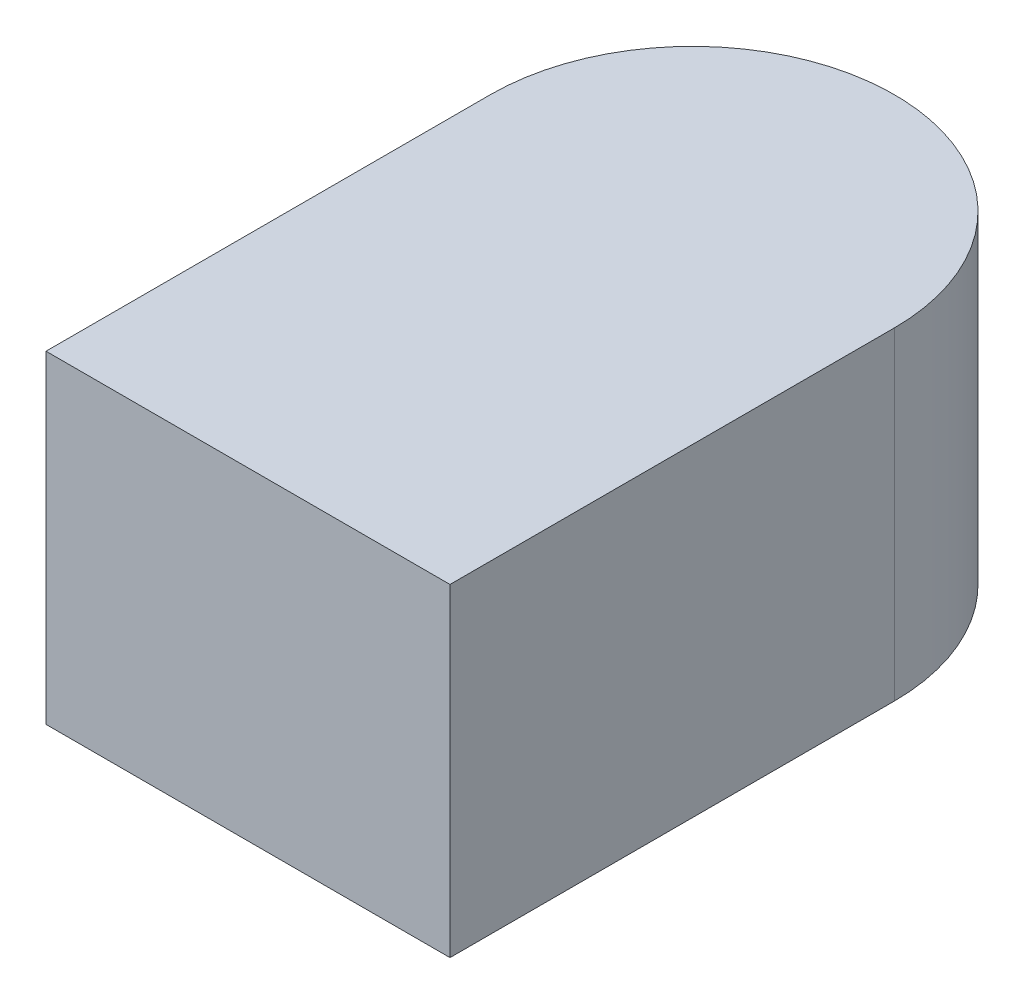
ISO-10303-21;
HEADER;
FILE_DESCRIPTION(('STEP AP214'),'2;1');
FILE_NAME('part.step','',(''),(''),'','','');
FILE_SCHEMA(('AUTOMOTIVE_DESIGN { 1 0 10303 214 1 1 1 1 }'));
ENDSEC;
DATA;
#1=APPLICATION_CONTEXT('core data for automotive mechanical design processes');
#2=APPLICATION_PROTOCOL_DEFINITION('international standard','automotive_design',2000,#1);
#3=PRODUCT_CONTEXT('',#1,'mechanical');
#4=PRODUCT('Part','Part','',(#3));
#5=PRODUCT_RELATED_PRODUCT_CATEGORY('part','',(#4));
#6=PRODUCT_DEFINITION_FORMATION('','',#4);
#7=PRODUCT_DEFINITION_CONTEXT('part definition',#1,'design');
#8=PRODUCT_DEFINITION('design','',#6,#7);
#9=PRODUCT_DEFINITION_SHAPE('','',#8);
#10=(LENGTH_UNIT() NAMED_UNIT(*) SI_UNIT(.MILLI.,.METRE.));
#11=(NAMED_UNIT(*) PLANE_ANGLE_UNIT() SI_UNIT($,.RADIAN.));
#12=(NAMED_UNIT(*) SI_UNIT($,.STERADIAN.) SOLID_ANGLE_UNIT());
#13=UNCERTAINTY_MEASURE_WITH_UNIT(LENGTH_MEASURE(1.E-05),#10,'distance_accuracy_value','');
#14=(GEOMETRIC_REPRESENTATION_CONTEXT(3) GLOBAL_UNCERTAINTY_ASSIGNED_CONTEXT((#13)) GLOBAL_UNIT_ASSIGNED_CONTEXT((#10,
#11,#12)) REPRESENTATION_CONTEXT('',''));
#15=CARTESIAN_POINT('',(0.,0.,0.));
#16=DIRECTION('',(0.,0.,1.));
#17=DIRECTION('',(1.,0.,0.));
#18=AXIS2_PLACEMENT_3D('',#15,#16,#17);
#19=CARTESIAN_POINT('',(0.,0.,0.));
#20=DIRECTION('',(0.,-1.,0.));
#21=DIRECTION('',(1.,0.,0.));
#22=AXIS2_PLACEMENT_3D('',#19,#20,#21);
#23=PLANE('',#22);
#24=CARTESIAN_POINT('',(0.25,0.,1.225));
#25=DIRECTION('',(0.,-1.,0.));
#26=DIRECTION('',(-1.,0.,0.));
#27=AXIS2_PLACEMENT_3D('',#24,#25,#26);
#28=CIRCLE('',#27,0.125);
#29=CARTESIAN_POINT('',(0.125,0.,1.225));
#30=VERTEX_POINT('',#29);
#31=CARTESIAN_POINT('',(0.375,0.,1.225));
#32=VERTEX_POINT('',#31);
#33=EDGE_CURVE('E11',#30,#32,#28,.T.);
#34=ORIENTED_EDGE('',*,*,#33,.T.);
#35=DIRECTION('',(0.,0.,1.));
#36=VECTOR('',#35,1.);
#37=CARTESIAN_POINT('',(0.375,0.,1.225));
#38=LINE('',#37,#36);
#39=CARTESIAN_POINT('',(0.375,0.,1.5));
#40=VERTEX_POINT('',#39);
#41=EDGE_CURVE('E24',#32,#40,#38,.T.);
#42=ORIENTED_EDGE('',*,*,#41,.T.);
#43=DIRECTION('',(-1.,0.,0.));
#44=VECTOR('',#43,1.);
#45=CARTESIAN_POINT('',(0.375,0.,1.5));
#46=LINE('',#45,#44);
#47=CARTESIAN_POINT('',(0.125,0.,1.5));
#48=VERTEX_POINT('',#47);
#49=EDGE_CURVE('E62',#40,#48,#46,.T.);
#50=ORIENTED_EDGE('',*,*,#49,.T.);
#51=DIRECTION('',(0.,0.,-1.));
#52=VECTOR('',#51,1.);
#53=CARTESIAN_POINT('',(0.125,0.,1.5));
#54=LINE('',#53,#52);
#55=EDGE_CURVE('E36',#48,#30,#54,.T.);
#56=ORIENTED_EDGE('',*,*,#55,.T.);
#57=EDGE_LOOP('',(#34,#42,#50,#56));
#58=FACE_BOUND('',#57,.T.);
#59=ADVANCED_FACE('F17',(#58),#23,.T.);
#60=CARTESIAN_POINT('',(0.125,0.,1.5));
#61=DIRECTION('',(1.,0.,0.));
#62=DIRECTION('',(0.,0.,-1.));
#63=AXIS2_PLACEMENT_3D('',#60,#61,#62);
#64=PLANE('',#63);
#65=DIRECTION('',(0.,1.,0.));
#66=VECTOR('',#65,1.);
#67=CARTESIAN_POINT('',(0.125,0.,1.5));
#68=LINE('',#67,#66);
#69=CARTESIAN_POINT('',(0.125,0.2,1.5));
#70=VERTEX_POINT('',#69);
#71=EDGE_CURVE('E84',#48,#70,#68,.T.);
#72=ORIENTED_EDGE('',*,*,#71,.T.);
#73=DIRECTION('',(0.,0.,-1.));
#74=VECTOR('',#73,1.);
#75=CARTESIAN_POINT('',(0.125,0.2,1.5));
#76=LINE('',#75,#74);
#77=CARTESIAN_POINT('',(0.125,0.2,1.225));
#78=VERTEX_POINT('',#77);
#79=EDGE_CURVE('E74',#70,#78,#76,.T.);
#80=ORIENTED_EDGE('',*,*,#79,.T.);
#81=DIRECTION('',(0.,1.,0.));
#82=VECTOR('',#81,1.);
#83=CARTESIAN_POINT('',(0.125,0.,1.225));
#84=LINE('',#83,#82);
#85=EDGE_CURVE('E81',#30,#78,#84,.T.);
#86=ORIENTED_EDGE('',*,*,#85,.F.);
#87=ORIENTED_EDGE('',*,*,#55,.F.);
#88=EDGE_LOOP('',(#72,#80,#86,#87));
#89=FACE_BOUND('',#88,.T.);
#90=ADVANCED_FACE('F91',(#89),#64,.F.);
#91=CARTESIAN_POINT('',(0.25,0.,1.225));
#92=DIRECTION('',(0.,-1.,0.));
#93=DIRECTION('',(1.,0.,0.));
#94=AXIS2_PLACEMENT_3D('',#91,#92,#93);
#95=CYLINDRICAL_SURFACE('',#94,0.125);
#96=ORIENTED_EDGE('',*,*,#85,.T.);
#97=CARTESIAN_POINT('',(0.25,0.2,1.225));
#98=DIRECTION('',(0.,-1.,0.));
#99=DIRECTION('',(-1.,0.,0.));
#100=AXIS2_PLACEMENT_3D('',#97,#98,#99);
#101=CIRCLE('',#100,0.125);
#102=CARTESIAN_POINT('',(0.375,0.2,1.225));
#103=VERTEX_POINT('',#102);
#104=EDGE_CURVE('E79',#78,#103,#101,.T.);
#105=ORIENTED_EDGE('',*,*,#104,.T.);
#106=DIRECTION('',(0.,1.,0.));
#107=VECTOR('',#106,1.);
#108=CARTESIAN_POINT('',(0.375,0.,1.225));
#109=LINE('',#108,#107);
#110=EDGE_CURVE('E68',#32,#103,#109,.T.);
#111=ORIENTED_EDGE('',*,*,#110,.F.);
#112=ORIENTED_EDGE('',*,*,#33,.F.);
#113=EDGE_LOOP('',(#96,#105,#111,#112));
#114=FACE_BOUND('',#113,.T.);
#115=ADVANCED_FACE('F89',(#114),#95,.T.);
#116=CARTESIAN_POINT('',(0.375,0.,1.225));
#117=DIRECTION('',(-1.,0.,0.));
#118=DIRECTION('',(0.,0.,1.));
#119=AXIS2_PLACEMENT_3D('',#116,#117,#118);
#120=PLANE('',#119);
#121=ORIENTED_EDGE('',*,*,#110,.T.);
#122=DIRECTION('',(0.,0.,1.));
#123=VECTOR('',#122,1.);
#124=CARTESIAN_POINT('',(0.375,0.2,1.225));
#125=LINE('',#124,#123);
#126=CARTESIAN_POINT('',(0.375,0.2,1.5));
#127=VERTEX_POINT('',#126);
#128=EDGE_CURVE('E63',#103,#127,#125,.T.);
#129=ORIENTED_EDGE('',*,*,#128,.T.);
#130=DIRECTION('',(0.,1.,0.));
#131=VECTOR('',#130,1.);
#132=CARTESIAN_POINT('',(0.375,0.,1.5));
#133=LINE('',#132,#131);
#134=EDGE_CURVE('E56',#40,#127,#133,.T.);
#135=ORIENTED_EDGE('',*,*,#134,.F.);
#136=ORIENTED_EDGE('',*,*,#41,.F.);
#137=EDGE_LOOP('',(#121,#129,#135,#136));
#138=FACE_BOUND('',#137,.T.);
#139=ADVANCED_FACE('F66',(#138),#120,.F.);
#140=CARTESIAN_POINT('',(0.375,0.,1.5));
#141=DIRECTION('',(0.,0.,-1.));
#142=DIRECTION('',(-1.,0.,0.));
#143=AXIS2_PLACEMENT_3D('',#140,#141,#142);
#144=PLANE('',#143);
#145=ORIENTED_EDGE('',*,*,#134,.T.);
#146=DIRECTION('',(-1.,0.,0.));
#147=VECTOR('',#146,1.);
#148=CARTESIAN_POINT('',(0.375,0.2,1.5));
#149=LINE('',#148,#147);
#150=EDGE_CURVE('E61',#127,#70,#149,.T.);
#151=ORIENTED_EDGE('',*,*,#150,.T.);
#152=ORIENTED_EDGE('',*,*,#71,.F.);
#153=ORIENTED_EDGE('',*,*,#49,.F.);
#154=EDGE_LOOP('',(#145,#151,#152,#153));
#155=FACE_BOUND('',#154,.T.);
#156=ADVANCED_FACE('F58',(#155),#144,.F.);
#157=CARTESIAN_POINT('',(0.,0.2,0.));
#158=DIRECTION('',(0.,-1.,0.));
#159=DIRECTION('',(1.,0.,0.));
#160=AXIS2_PLACEMENT_3D('',#157,#158,#159);
#161=PLANE('',#160);
#162=ORIENTED_EDGE('',*,*,#150,.F.);
#163=ORIENTED_EDGE('',*,*,#128,.F.);
#164=ORIENTED_EDGE('',*,*,#104,.F.);
#165=ORIENTED_EDGE('',*,*,#79,.F.);
#166=EDGE_LOOP('',(#162,#163,#164,#165));
#167=FACE_BOUND('',#166,.T.);
#168=ADVANCED_FACE('F72',(#167),#161,.F.);
#169=CLOSED_SHELL('',(#59,#90,#115,#139,#156,#168));
#170=MANIFOLD_SOLID_BREP('B1',#169);
#171=ADVANCED_BREP_SHAPE_REPRESENTATION('',(#18,#170),#14);
#172=SHAPE_DEFINITION_REPRESENTATION(#9,#171);
ENDSEC;
END-ISO-10303-21;
